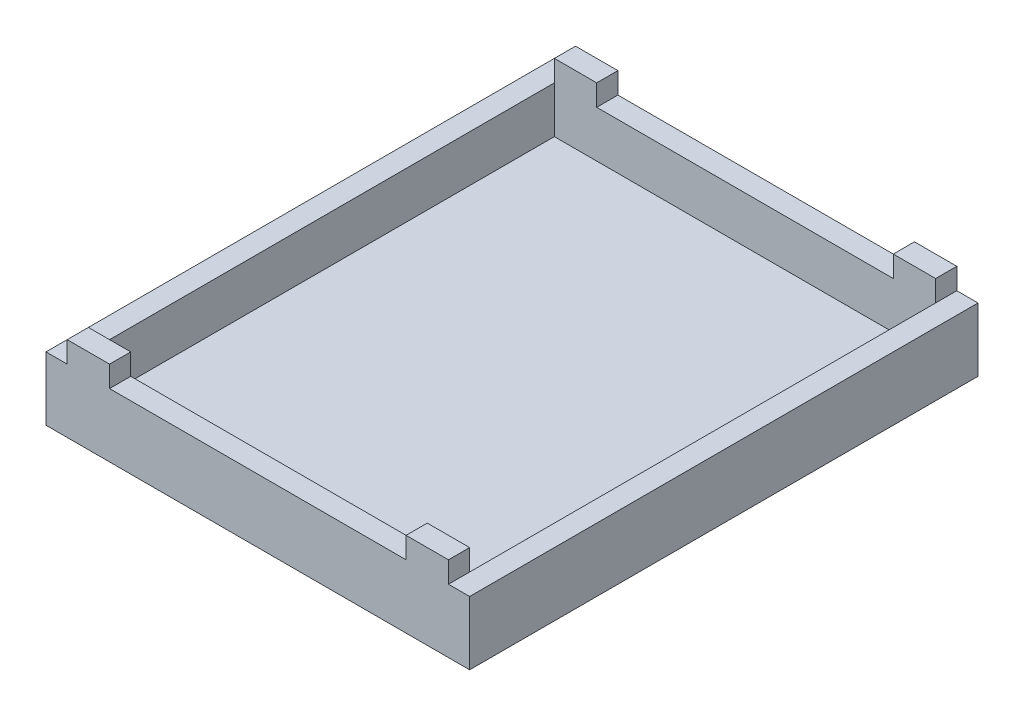
ISO-10303-21;
HEADER;
FILE_DESCRIPTION(('STEP AP214'),'2;1');
FILE_NAME('part.step','',(''),(''),'','','');
FILE_SCHEMA(('AUTOMOTIVE_DESIGN { 1 0 10303 214 1 1 1 1 }'));
ENDSEC;
DATA;
#1=APPLICATION_CONTEXT('core data for automotive mechanical design processes');
#2=APPLICATION_PROTOCOL_DEFINITION('international standard','automotive_design',2000,#1);
#3=PRODUCT_CONTEXT('',#1,'mechanical');
#4=PRODUCT('Part','Part','',(#3));
#5=PRODUCT_RELATED_PRODUCT_CATEGORY('part','',(#4));
#6=PRODUCT_DEFINITION_FORMATION('','',#4);
#7=PRODUCT_DEFINITION_CONTEXT('part definition',#1,'design');
#8=PRODUCT_DEFINITION('design','',#6,#7);
#9=PRODUCT_DEFINITION_SHAPE('','',#8);
#10=(LENGTH_UNIT() NAMED_UNIT(*) SI_UNIT(.MILLI.,.METRE.));
#11=(NAMED_UNIT(*) PLANE_ANGLE_UNIT() SI_UNIT($,.RADIAN.));
#12=(NAMED_UNIT(*) SI_UNIT($,.STERADIAN.) SOLID_ANGLE_UNIT());
#13=UNCERTAINTY_MEASURE_WITH_UNIT(LENGTH_MEASURE(1.E-05),#10,'distance_accuracy_value','');
#14=(GEOMETRIC_REPRESENTATION_CONTEXT(3) GLOBAL_UNCERTAINTY_ASSIGNED_CONTEXT((#13)) GLOBAL_UNIT_ASSIGNED_CONTEXT((#10,
#11,#12)) REPRESENTATION_CONTEXT('',''));
#15=CARTESIAN_POINT('',(0.,0.,0.));
#16=DIRECTION('',(0.,0.,1.));
#17=DIRECTION('',(1.,0.,0.));
#18=AXIS2_PLACEMENT_3D('',#15,#16,#17);
#19=CARTESIAN_POINT('',(0.,20.,0.));
#20=DIRECTION('',(0.,1.,0.));
#21=DIRECTION('',(0.,0.,1.));
#22=AXIS2_PLACEMENT_3D('',#19,#20,#21);
#23=PLANE('',#22);
#24=DIRECTION('',(0.,0.,1.));
#25=VECTOR('',#24,1.);
#26=CARTESIAN_POINT('',(-45.,20.,-60.));
#27=LINE('',#26,#25);
#28=CARTESIAN_POINT('',(-45.,20.,55.));
#29=VERTEX_POINT('',#28);
#30=CARTESIAN_POINT('',(-45.,20.,60.));
#31=VERTEX_POINT('',#30);
#32=EDGE_CURVE('E321',#29,#31,#27,.T.);
#33=ORIENTED_EDGE('',*,*,#32,.T.);
#34=DIRECTION('',(1.,0.,0.));
#35=VECTOR('',#34,1.);
#36=CARTESIAN_POINT('',(-50.,20.,60.));
#37=LINE('',#36,#35);
#38=CARTESIAN_POINT('',(-35.,20.,60.));
#39=VERTEX_POINT('',#38);
#40=EDGE_CURVE('E298',#31,#39,#37,.T.);
#41=ORIENTED_EDGE('',*,*,#40,.T.);
#42=DIRECTION('',(0.,0.,1.));
#43=VECTOR('',#42,1.);
#44=CARTESIAN_POINT('',(-35.,20.,-60.));
#45=LINE('',#44,#43);
#46=CARTESIAN_POINT('',(-35.,20.,55.));
#47=VERTEX_POINT('',#46);
#48=EDGE_CURVE('E320',#47,#39,#45,.T.);
#49=ORIENTED_EDGE('',*,*,#48,.F.);
#50=DIRECTION('',(1.,0.,0.));
#51=VECTOR('',#50,1.);
#52=CARTESIAN_POINT('',(-45.,20.,55.));
#53=LINE('',#52,#51);
#54=EDGE_CURVE('E252',#29,#47,#53,.T.);
#55=ORIENTED_EDGE('',*,*,#54,.F.);
#56=EDGE_LOOP('',(#33,#41,#49,#55));
#57=FACE_BOUND('',#56,.T.);
#58=ADVANCED_FACE('F41',(#57),#23,.T.);
#59=DIRECTION('',(0.,0.,1.));
#60=VECTOR('',#59,1.);
#61=CARTESIAN_POINT('',(45.,20.,-60.));
#62=LINE('',#61,#60);
#63=CARTESIAN_POINT('',(45.,20.,-60.));
#64=VERTEX_POINT('',#63);
#65=CARTESIAN_POINT('',(45.,20.,-55.));
#66=VERTEX_POINT('',#65);
#67=EDGE_CURVE('E432',#64,#66,#62,.T.);
#68=ORIENTED_EDGE('',*,*,#67,.F.);
#69=DIRECTION('',(-1.,0.,0.));
#70=VECTOR('',#69,1.);
#71=CARTESIAN_POINT('',(-50.,20.,-60.));
#72=LINE('',#71,#70);
#73=CARTESIAN_POINT('',(35.,20.,-60.));
#74=VERTEX_POINT('',#73);
#75=EDGE_CURVE('E293',#64,#74,#72,.T.);
#76=ORIENTED_EDGE('',*,*,#75,.T.);
#77=DIRECTION('',(0.,0.,1.));
#78=VECTOR('',#77,1.);
#79=CARTESIAN_POINT('',(35.,20.,-60.));
#80=LINE('',#79,#78);
#81=CARTESIAN_POINT('',(35.,20.,-55.));
#82=VERTEX_POINT('',#81);
#83=EDGE_CURVE('E349',#74,#82,#80,.T.);
#84=ORIENTED_EDGE('',*,*,#83,.T.);
#85=DIRECTION('',(-1.,0.,0.));
#86=VECTOR('',#85,1.);
#87=CARTESIAN_POINT('',(-45.,20.,-55.));
#88=LINE('',#87,#86);
#89=EDGE_CURVE('E265',#66,#82,#88,.T.);
#90=ORIENTED_EDGE('',*,*,#89,.F.);
#91=EDGE_LOOP('',(#68,#76,#84,#90));
#92=FACE_BOUND('',#91,.T.);
#93=ADVANCED_FACE('F483',(#92),#23,.T.);
#94=CARTESIAN_POINT('',(-45.,20.,-60.));
#95=VERTEX_POINT('',#94);
#96=CARTESIAN_POINT('',(-45.,20.,-55.));
#97=VERTEX_POINT('',#96);
#98=EDGE_CURVE('E365',#95,#97,#27,.T.);
#99=ORIENTED_EDGE('',*,*,#98,.T.);
#100=CARTESIAN_POINT('',(-35.,20.,-55.));
#101=VERTEX_POINT('',#100);
#102=EDGE_CURVE('E257',#101,#97,#88,.T.);
#103=ORIENTED_EDGE('',*,*,#102,.F.);
#104=CARTESIAN_POINT('',(-35.,20.,-60.));
#105=VERTEX_POINT('',#104);
#106=EDGE_CURVE('E345',#105,#101,#45,.T.);
#107=ORIENTED_EDGE('',*,*,#106,.F.);
#108=EDGE_CURVE('E289',#105,#95,#72,.T.);
#109=ORIENTED_EDGE('',*,*,#108,.T.);
#110=EDGE_LOOP('',(#99,#103,#107,#109));
#111=FACE_BOUND('',#110,.T.);
#112=ADVANCED_FACE('F470',(#111),#23,.T.);
#113=CARTESIAN_POINT('',(50.,20.,-60.));
#114=DIRECTION('',(-1.,0.,0.));
#115=DIRECTION('',(0.,0.,1.));
#116=AXIS2_PLACEMENT_3D('',#113,#114,#115);
#117=PLANE('',#116);
#118=DIRECTION('',(0.,-1.,0.));
#119=VECTOR('',#118,1.);
#120=CARTESIAN_POINT('',(50.,20.,-60.));
#121=LINE('',#120,#119);
#122=CARTESIAN_POINT('',(50.,15.,-60.));
#123=VERTEX_POINT('',#122);
#124=CARTESIAN_POINT('',(50.,0.,-60.));
#125=VERTEX_POINT('',#124);
#126=EDGE_CURVE('E221',#123,#125,#121,.T.);
#127=ORIENTED_EDGE('',*,*,#126,.F.);
#128=DIRECTION('',(0.,0.,1.));
#129=VECTOR('',#128,1.);
#130=CARTESIAN_POINT('',(50.,15.,-60.));
#131=LINE('',#130,#129);
#132=CARTESIAN_POINT('',(50.,15.,60.));
#133=VERTEX_POINT('',#132);
#134=EDGE_CURVE('E423',#123,#133,#131,.T.);
#135=ORIENTED_EDGE('',*,*,#134,.T.);
#136=DIRECTION('',(0.,-1.,0.));
#137=VECTOR('',#136,1.);
#138=CARTESIAN_POINT('',(50.,20.,60.));
#139=LINE('',#138,#137);
#140=CARTESIAN_POINT('',(50.,0.,60.));
#141=VERTEX_POINT('',#140);
#142=EDGE_CURVE('E227',#133,#141,#139,.T.);
#143=ORIENTED_EDGE('',*,*,#142,.T.);
#144=DIRECTION('',(0.,0.,-1.));
#145=VECTOR('',#144,1.);
#146=CARTESIAN_POINT('',(50.,0.,-60.));
#147=LINE('',#146,#145);
#148=EDGE_CURVE('E274',#141,#125,#147,.T.);
#149=ORIENTED_EDGE('',*,*,#148,.T.);
#150=EDGE_LOOP('',(#127,#135,#143,#149));
#151=FACE_BOUND('',#150,.T.);
#152=ADVANCED_FACE('F43',(#151),#117,.F.);
#153=CARTESIAN_POINT('',(-50.,20.,-60.));
#154=DIRECTION('',(0.,0.,1.));
#155=DIRECTION('',(1.,0.,0.));
#156=AXIS2_PLACEMENT_3D('',#153,#154,#155);
#157=PLANE('',#156);
#158=DIRECTION('',(1.,0.,0.));
#159=VECTOR('',#158,1.);
#160=CARTESIAN_POINT('',(-50.,15.,-60.));
#161=LINE('',#160,#159);
#162=CARTESIAN_POINT('',(-50.,15.,-60.));
#163=VERTEX_POINT('',#162);
#164=CARTESIAN_POINT('',(-45.,15.,-60.));
#165=VERTEX_POINT('',#164);
#166=EDGE_CURVE('E190',#163,#165,#161,.T.);
#167=ORIENTED_EDGE('',*,*,#166,.T.);
#168=DIRECTION('',(0.,1.,0.));
#169=VECTOR('',#168,1.);
#170=CARTESIAN_POINT('',(-45.,20.,-60.));
#171=LINE('',#170,#169);
#172=EDGE_CURVE('E203',#165,#95,#171,.T.);
#173=ORIENTED_EDGE('',*,*,#172,.T.);
#174=ORIENTED_EDGE('',*,*,#108,.F.);
#175=DIRECTION('',(0.,-1.,0.));
#176=VECTOR('',#175,1.);
#177=CARTESIAN_POINT('',(-35.,20.,-60.));
#178=LINE('',#177,#176);
#179=CARTESIAN_POINT('',(-35.,15.,-60.));
#180=VERTEX_POINT('',#179);
#181=EDGE_CURVE('E344',#105,#180,#178,.T.);
#182=ORIENTED_EDGE('',*,*,#181,.T.);
#183=DIRECTION('',(1.,0.,0.));
#184=VECTOR('',#183,1.);
#185=CARTESIAN_POINT('',(-35.,15.,-60.));
#186=LINE('',#185,#184);
#187=CARTESIAN_POINT('',(35.,15.,-60.));
#188=VERTEX_POINT('',#187);
#189=EDGE_CURVE('E437',#180,#188,#186,.T.);
#190=ORIENTED_EDGE('',*,*,#189,.T.);
#191=DIRECTION('',(0.,1.,0.));
#192=VECTOR('',#191,1.);
#193=CARTESIAN_POINT('',(35.,20.,-60.));
#194=LINE('',#193,#192);
#195=EDGE_CURVE('E339',#188,#74,#194,.T.);
#196=ORIENTED_EDGE('',*,*,#195,.T.);
#197=ORIENTED_EDGE('',*,*,#75,.F.);
#198=DIRECTION('',(0.,-1.,0.));
#199=VECTOR('',#198,1.);
#200=CARTESIAN_POINT('',(45.,20.,-60.));
#201=LINE('',#200,#199);
#202=CARTESIAN_POINT('',(45.,15.,-60.));
#203=VERTEX_POINT('',#202);
#204=EDGE_CURVE('E409',#64,#203,#201,.T.);
#205=ORIENTED_EDGE('',*,*,#204,.T.);
#206=DIRECTION('',(1.,0.,0.));
#207=VECTOR('',#206,1.);
#208=CARTESIAN_POINT('',(50.,15.,-60.));
#209=LINE('',#208,#207);
#210=EDGE_CURVE('E413',#203,#123,#209,.T.);
#211=ORIENTED_EDGE('',*,*,#210,.T.);
#212=ORIENTED_EDGE('',*,*,#126,.T.);
#213=DIRECTION('',(-1.,0.,0.));
#214=VECTOR('',#213,1.);
#215=CARTESIAN_POINT('',(-50.,0.,-60.));
#216=LINE('',#215,#214);
#217=CARTESIAN_POINT('',(-50.,0.,-60.));
#218=VERTEX_POINT('',#217);
#219=EDGE_CURVE('E218',#125,#218,#216,.T.);
#220=ORIENTED_EDGE('',*,*,#219,.T.);
#221=DIRECTION('',(0.,-1.,0.));
#222=VECTOR('',#221,1.);
#223=CARTESIAN_POINT('',(-50.,20.,-60.));
#224=LINE('',#223,#222);
#225=EDGE_CURVE('E210',#163,#218,#224,.T.);
#226=ORIENTED_EDGE('',*,*,#225,.F.);
#227=EDGE_LOOP('',(#167,#173,#174,#182,#190,#196,#197,#205,#211,#212,#220,#226));
#228=FACE_BOUND('',#227,.T.);
#229=ADVANCED_FACE('F216',(#228),#157,.F.);
#230=CARTESIAN_POINT('',(-50.,20.,-60.));
#231=DIRECTION('',(1.,0.,0.));
#232=DIRECTION('',(0.,0.,-1.));
#233=AXIS2_PLACEMENT_3D('',#230,#231,#232);
#234=PLANE('',#233);
#235=DIRECTION('',(0.,-1.,0.));
#236=VECTOR('',#235,1.);
#237=CARTESIAN_POINT('',(-50.,20.,60.));
#238=LINE('',#237,#236);
#239=CARTESIAN_POINT('',(-50.,15.,60.));
#240=VERTEX_POINT('',#239);
#241=CARTESIAN_POINT('',(-50.,0.,60.));
#242=VERTEX_POINT('',#241);
#243=EDGE_CURVE('E212',#240,#242,#238,.T.);
#244=ORIENTED_EDGE('',*,*,#243,.F.);
#245=DIRECTION('',(0.,0.,1.));
#246=VECTOR('',#245,1.);
#247=CARTESIAN_POINT('',(-50.,15.,-60.));
#248=LINE('',#247,#246);
#249=EDGE_CURVE('E194',#163,#240,#248,.T.);
#250=ORIENTED_EDGE('',*,*,#249,.F.);
#251=ORIENTED_EDGE('',*,*,#225,.T.);
#252=DIRECTION('',(0.,0.,1.));
#253=VECTOR('',#252,1.);
#254=CARTESIAN_POINT('',(-50.,0.,-60.));
#255=LINE('',#254,#253);
#256=EDGE_CURVE('E304',#218,#242,#255,.T.);
#257=ORIENTED_EDGE('',*,*,#256,.T.);
#258=EDGE_LOOP('',(#244,#250,#251,#257));
#259=FACE_BOUND('',#258,.T.);
#260=ADVANCED_FACE('F208',(#259),#234,.F.);
#261=CARTESIAN_POINT('',(-50.,20.,60.));
#262=DIRECTION('',(0.,0.,-1.));
#263=DIRECTION('',(-1.,0.,0.));
#264=AXIS2_PLACEMENT_3D('',#261,#262,#263);
#265=PLANE('',#264);
#266=ORIENTED_EDGE('',*,*,#40,.F.);
#267=DIRECTION('',(0.,1.,0.));
#268=VECTOR('',#267,1.);
#269=CARTESIAN_POINT('',(-45.,20.,60.));
#270=LINE('',#269,#268);
#271=CARTESIAN_POINT('',(-45.,15.,60.));
#272=VERTEX_POINT('',#271);
#273=EDGE_CURVE('E204',#272,#31,#270,.T.);
#274=ORIENTED_EDGE('',*,*,#273,.F.);
#275=DIRECTION('',(1.,0.,0.));
#276=VECTOR('',#275,1.);
#277=CARTESIAN_POINT('',(-50.,15.,60.));
#278=LINE('',#277,#276);
#279=EDGE_CURVE('E398',#240,#272,#278,.T.);
#280=ORIENTED_EDGE('',*,*,#279,.F.);
#281=ORIENTED_EDGE('',*,*,#243,.T.);
#282=DIRECTION('',(1.,0.,0.));
#283=VECTOR('',#282,1.);
#284=CARTESIAN_POINT('',(-50.,0.,60.));
#285=LINE('',#284,#283);
#286=EDGE_CURVE('E294',#242,#141,#285,.T.);
#287=ORIENTED_EDGE('',*,*,#286,.T.);
#288=ORIENTED_EDGE('',*,*,#142,.F.);
#289=DIRECTION('',(1.,0.,0.));
#290=VECTOR('',#289,1.);
#291=CARTESIAN_POINT('',(50.,15.,60.));
#292=LINE('',#291,#290);
#293=CARTESIAN_POINT('',(45.,15.,60.));
#294=VERTEX_POINT('',#293);
#295=EDGE_CURVE('E414',#294,#133,#292,.T.);
#296=ORIENTED_EDGE('',*,*,#295,.F.);
#297=DIRECTION('',(0.,-1.,0.));
#298=VECTOR('',#297,1.);
#299=CARTESIAN_POINT('',(45.,20.,60.));
#300=LINE('',#299,#298);
#301=CARTESIAN_POINT('',(45.,20.,60.));
#302=VERTEX_POINT('',#301);
#303=EDGE_CURVE('E348',#302,#294,#300,.T.);
#304=ORIENTED_EDGE('',*,*,#303,.F.);
#305=CARTESIAN_POINT('',(35.,20.,60.));
#306=VERTEX_POINT('',#305);
#307=EDGE_CURVE('E295',#306,#302,#37,.T.);
#308=ORIENTED_EDGE('',*,*,#307,.F.);
#309=DIRECTION('',(0.,1.,0.));
#310=VECTOR('',#309,1.);
#311=CARTESIAN_POINT('',(35.,20.,60.));
#312=LINE('',#311,#310);
#313=CARTESIAN_POINT('',(35.,15.,60.));
#314=VERTEX_POINT('',#313);
#315=EDGE_CURVE('E336',#314,#306,#312,.T.);
#316=ORIENTED_EDGE('',*,*,#315,.F.);
#317=DIRECTION('',(1.,0.,0.));
#318=VECTOR('',#317,1.);
#319=CARTESIAN_POINT('',(-35.,15.,60.));
#320=LINE('',#319,#318);
#321=CARTESIAN_POINT('',(-35.,15.,60.));
#322=VERTEX_POINT('',#321);
#323=EDGE_CURVE('E330',#322,#314,#320,.T.);
#324=ORIENTED_EDGE('',*,*,#323,.F.);
#325=DIRECTION('',(0.,-1.,0.));
#326=VECTOR('',#325,1.);
#327=CARTESIAN_POINT('',(-35.,20.,60.));
#328=LINE('',#327,#326);
#329=EDGE_CURVE('E328',#39,#322,#328,.T.);
#330=ORIENTED_EDGE('',*,*,#329,.F.);
#331=EDGE_LOOP('',(#266,#274,#280,#281,#287,#288,#296,#304,#308,#316,#324,#330));
#332=FACE_BOUND('',#331,.T.);
#333=ADVANCED_FACE('F325',(#332),#265,.F.);
#334=CARTESIAN_POINT('',(45.,20.,55.));
#335=VERTEX_POINT('',#334);
#336=EDGE_CURVE('E250',#335,#302,#62,.T.);
#337=ORIENTED_EDGE('',*,*,#336,.F.);
#338=CARTESIAN_POINT('',(35.,20.,55.));
#339=VERTEX_POINT('',#338);
#340=EDGE_CURVE('E241',#339,#335,#53,.T.);
#341=ORIENTED_EDGE('',*,*,#340,.F.);
#342=EDGE_CURVE('E248',#339,#306,#80,.T.);
#343=ORIENTED_EDGE('',*,*,#342,.T.);
#344=ORIENTED_EDGE('',*,*,#307,.T.);
#345=EDGE_LOOP('',(#337,#341,#343,#344));
#346=FACE_BOUND('',#345,.T.);
#347=ADVANCED_FACE('F246',(#346),#23,.T.);
#348=CARTESIAN_POINT('',(0.,0.,0.));
#349=DIRECTION('',(0.,1.,0.));
#350=DIRECTION('',(0.,0.,1.));
#351=AXIS2_PLACEMENT_3D('',#348,#349,#350);
#352=PLANE('',#351);
#353=ORIENTED_EDGE('',*,*,#148,.F.);
#354=ORIENTED_EDGE('',*,*,#286,.F.);
#355=ORIENTED_EDGE('',*,*,#256,.F.);
#356=ORIENTED_EDGE('',*,*,#219,.F.);
#357=EDGE_LOOP('',(#353,#354,#355,#356));
#358=FACE_BOUND('',#357,.T.);
#359=ADVANCED_FACE('F513',(#358),#352,.F.);
#360=CARTESIAN_POINT('',(-45.,4.,-55.));
#361=DIRECTION('',(-1.,0.,0.));
#362=DIRECTION('',(0.,0.,1.));
#363=AXIS2_PLACEMENT_3D('',#360,#361,#362);
#364=PLANE('',#363);
#365=DIRECTION('',(0.,1.,0.));
#366=VECTOR('',#365,1.);
#367=CARTESIAN_POINT('',(-45.,4.,-55.));
#368=LINE('',#367,#366);
#369=CARTESIAN_POINT('',(-45.,4.,-55.));
#370=VERTEX_POINT('',#369);
#371=CARTESIAN_POINT('',(-45.,15.,-55.));
#372=VERTEX_POINT('',#371);
#373=EDGE_CURVE('E270',#370,#372,#368,.T.);
#374=ORIENTED_EDGE('',*,*,#373,.T.);
#375=DIRECTION('',(0.,0.,1.));
#376=VECTOR('',#375,1.);
#377=CARTESIAN_POINT('',(-45.,15.,-60.));
#378=LINE('',#377,#376);
#379=CARTESIAN_POINT('',(-45.,15.,55.));
#380=VERTEX_POINT('',#379);
#381=EDGE_CURVE('E397',#372,#380,#378,.T.);
#382=ORIENTED_EDGE('',*,*,#381,.T.);
#383=DIRECTION('',(0.,1.,0.));
#384=VECTOR('',#383,1.);
#385=CARTESIAN_POINT('',(-45.,4.,55.));
#386=LINE('',#385,#384);
#387=CARTESIAN_POINT('',(-45.,4.,55.));
#388=VERTEX_POINT('',#387);
#389=EDGE_CURVE('E284',#388,#380,#386,.T.);
#390=ORIENTED_EDGE('',*,*,#389,.F.);
#391=DIRECTION('',(0.,0.,1.));
#392=VECTOR('',#391,1.);
#393=CARTESIAN_POINT('',(-45.,4.,-55.));
#394=LINE('',#393,#392);
#395=EDGE_CURVE('E269',#370,#388,#394,.T.);
#396=ORIENTED_EDGE('',*,*,#395,.F.);
#397=EDGE_LOOP('',(#374,#382,#390,#396));
#398=FACE_BOUND('',#397,.T.);
#399=ADVANCED_FACE('F402',(#398),#364,.F.);
#400=CARTESIAN_POINT('',(-45.,4.,-55.));
#401=DIRECTION('',(0.,0.,-1.));
#402=DIRECTION('',(-1.,0.,0.));
#403=AXIS2_PLACEMENT_3D('',#400,#401,#402);
#404=PLANE('',#403);
#405=DIRECTION('',(-1.,0.,0.));
#406=VECTOR('',#405,1.);
#407=CARTESIAN_POINT('',(-45.,15.,-55.));
#408=LINE('',#407,#406);
#409=CARTESIAN_POINT('',(35.,15.,-55.));
#410=VERTEX_POINT('',#409);
#411=CARTESIAN_POINT('',(-35.,15.,-55.));
#412=VERTEX_POINT('',#411);
#413=EDGE_CURVE('E360',#410,#412,#408,.T.);
#414=ORIENTED_EDGE('',*,*,#413,.T.);
#415=DIRECTION('',(0.,1.,0.));
#416=VECTOR('',#415,1.);
#417=CARTESIAN_POINT('',(-35.,4.,-55.));
#418=LINE('',#417,#416);
#419=EDGE_CURVE('E369',#412,#101,#418,.T.);
#420=ORIENTED_EDGE('',*,*,#419,.T.);
#421=ORIENTED_EDGE('',*,*,#102,.T.);
#422=DIRECTION('',(0.,-1.,0.));
#423=VECTOR('',#422,1.);
#424=CARTESIAN_POINT('',(-45.,4.,-55.));
#425=LINE('',#424,#423);
#426=EDGE_CURVE('E253',#97,#372,#425,.T.);
#427=ORIENTED_EDGE('',*,*,#426,.T.);
#428=ORIENTED_EDGE('',*,*,#373,.F.);
#429=DIRECTION('',(-1.,0.,0.));
#430=VECTOR('',#429,1.);
#431=CARTESIAN_POINT('',(-45.,4.,-55.));
#432=LINE('',#431,#430);
#433=CARTESIAN_POINT('',(45.,4.,-55.));
#434=VERTEX_POINT('',#433);
#435=EDGE_CURVE('E263',#434,#370,#432,.T.);
#436=ORIENTED_EDGE('',*,*,#435,.F.);
#437=DIRECTION('',(0.,1.,0.));
#438=VECTOR('',#437,1.);
#439=CARTESIAN_POINT('',(45.,4.,-55.));
#440=LINE('',#439,#438);
#441=CARTESIAN_POINT('',(45.,15.,-55.));
#442=VERTEX_POINT('',#441);
#443=EDGE_CURVE('E275',#434,#442,#440,.T.);
#444=ORIENTED_EDGE('',*,*,#443,.T.);
#445=DIRECTION('',(0.,1.,0.));
#446=VECTOR('',#445,1.);
#447=CARTESIAN_POINT('',(45.,4.,-55.));
#448=LINE('',#447,#446);
#449=EDGE_CURVE('E259',#442,#66,#448,.T.);
#450=ORIENTED_EDGE('',*,*,#449,.T.);
#451=ORIENTED_EDGE('',*,*,#89,.T.);
#452=DIRECTION('',(0.,-1.,0.));
#453=VECTOR('',#452,1.);
#454=CARTESIAN_POINT('',(35.,4.,-55.));
#455=LINE('',#454,#453);
#456=EDGE_CURVE('E364',#82,#410,#455,.T.);
#457=ORIENTED_EDGE('',*,*,#456,.T.);
#458=EDGE_LOOP('',(#414,#420,#421,#427,#428,#436,#444,#450,#451,#457));
#459=FACE_BOUND('',#458,.T.);
#460=ADVANCED_FACE('F476',(#459),#404,.F.);
#461=CARTESIAN_POINT('',(45.,4.,-55.));
#462=DIRECTION('',(1.,0.,0.));
#463=DIRECTION('',(0.,0.,-1.));
#464=AXIS2_PLACEMENT_3D('',#461,#462,#463);
#465=PLANE('',#464);
#466=DIRECTION('',(0.,1.,0.));
#467=VECTOR('',#466,1.);
#468=CARTESIAN_POINT('',(45.,4.,55.));
#469=LINE('',#468,#467);
#470=CARTESIAN_POINT('',(45.,4.,55.));
#471=VERTEX_POINT('',#470);
#472=CARTESIAN_POINT('',(45.,15.,55.));
#473=VERTEX_POINT('',#472);
#474=EDGE_CURVE('E279',#471,#473,#469,.T.);
#475=ORIENTED_EDGE('',*,*,#474,.T.);
#476=DIRECTION('',(0.,0.,1.));
#477=VECTOR('',#476,1.);
#478=CARTESIAN_POINT('',(45.,15.,-60.));
#479=LINE('',#478,#477);
#480=EDGE_CURVE('E430',#442,#473,#479,.T.);
#481=ORIENTED_EDGE('',*,*,#480,.F.);
#482=ORIENTED_EDGE('',*,*,#443,.F.);
#483=DIRECTION('',(0.,0.,-1.));
#484=VECTOR('',#483,1.);
#485=CARTESIAN_POINT('',(45.,4.,-55.));
#486=LINE('',#485,#484);
#487=EDGE_CURVE('E382',#471,#434,#486,.T.);
#488=ORIENTED_EDGE('',*,*,#487,.F.);
#489=EDGE_LOOP('',(#475,#481,#482,#488));
#490=FACE_BOUND('',#489,.T.);
#491=ADVANCED_FACE('F491',(#490),#465,.F.);
#492=CARTESIAN_POINT('',(-45.,4.,55.));
#493=DIRECTION('',(0.,0.,1.));
#494=DIRECTION('',(1.,0.,0.));
#495=AXIS2_PLACEMENT_3D('',#492,#493,#494);
#496=PLANE('',#495);
#497=ORIENTED_EDGE('',*,*,#54,.T.);
#498=DIRECTION('',(0.,-1.,0.));
#499=VECTOR('',#498,1.);
#500=CARTESIAN_POINT('',(-35.,4.,55.));
#501=LINE('',#500,#499);
#502=CARTESIAN_POINT('',(-35.,15.,55.));
#503=VERTEX_POINT('',#502);
#504=EDGE_CURVE('E11',#47,#503,#501,.T.);
#505=ORIENTED_EDGE('',*,*,#504,.T.);
#506=DIRECTION('',(1.,0.,0.));
#507=VECTOR('',#506,1.);
#508=CARTESIAN_POINT('',(-45.,15.,55.));
#509=LINE('',#508,#507);
#510=CARTESIAN_POINT('',(35.,15.,55.));
#511=VERTEX_POINT('',#510);
#512=EDGE_CURVE('E225',#503,#511,#509,.T.);
#513=ORIENTED_EDGE('',*,*,#512,.T.);
#514=DIRECTION('',(0.,1.,0.));
#515=VECTOR('',#514,1.);
#516=CARTESIAN_POINT('',(35.,4.,55.));
#517=LINE('',#516,#515);
#518=EDGE_CURVE('E50',#511,#339,#517,.T.);
#519=ORIENTED_EDGE('',*,*,#518,.T.);
#520=ORIENTED_EDGE('',*,*,#340,.T.);
#521=EDGE_CURVE('E283',#473,#335,#469,.T.);
#522=ORIENTED_EDGE('',*,*,#521,.F.);
#523=ORIENTED_EDGE('',*,*,#474,.F.);
#524=DIRECTION('',(1.,0.,0.));
#525=VECTOR('',#524,1.);
#526=CARTESIAN_POINT('',(-45.,4.,55.));
#527=LINE('',#526,#525);
#528=EDGE_CURVE('E379',#388,#471,#527,.T.);
#529=ORIENTED_EDGE('',*,*,#528,.F.);
#530=ORIENTED_EDGE('',*,*,#389,.T.);
#531=EDGE_CURVE('E288',#380,#29,#386,.T.);
#532=ORIENTED_EDGE('',*,*,#531,.T.);
#533=EDGE_LOOP('',(#497,#505,#513,#519,#520,#522,#523,#529,#530,#532));
#534=FACE_BOUND('',#533,.T.);
#535=ADVANCED_FACE('F239',(#534),#496,.F.);
#536=CARTESIAN_POINT('',(0.,4.,0.));
#537=DIRECTION('',(0.,1.,0.));
#538=DIRECTION('',(0.,0.,1.));
#539=AXIS2_PLACEMENT_3D('',#536,#537,#538);
#540=PLANE('',#539);
#541=ORIENTED_EDGE('',*,*,#395,.T.);
#542=ORIENTED_EDGE('',*,*,#528,.T.);
#543=ORIENTED_EDGE('',*,*,#487,.T.);
#544=ORIENTED_EDGE('',*,*,#435,.T.);
#545=EDGE_LOOP('',(#541,#542,#543,#544));
#546=FACE_BOUND('',#545,.T.);
#547=ADVANCED_FACE('F494',(#546),#540,.T.);
#548=CARTESIAN_POINT('',(-35.,15.,-60.));
#549=DIRECTION('',(0.,-1.,0.));
#550=DIRECTION('',(0.,0.,-1.));
#551=AXIS2_PLACEMENT_3D('',#548,#549,#550);
#552=PLANE('',#551);
#553=DIRECTION('',(0.,0.,1.));
#554=VECTOR('',#553,1.);
#555=CARTESIAN_POINT('',(-35.,15.,-60.));
#556=LINE('',#555,#554);
#557=EDGE_CURVE('E359',#503,#322,#556,.T.);
#558=ORIENTED_EDGE('',*,*,#557,.T.);
#559=ORIENTED_EDGE('',*,*,#323,.T.);
#560=DIRECTION('',(0.,0.,1.));
#561=VECTOR('',#560,1.);
#562=CARTESIAN_POINT('',(35.,15.,-60.));
#563=LINE('',#562,#561);
#564=EDGE_CURVE('E65',#511,#314,#563,.T.);
#565=ORIENTED_EDGE('',*,*,#564,.F.);
#566=ORIENTED_EDGE('',*,*,#512,.F.);
#567=EDGE_LOOP('',(#558,#559,#565,#566));
#568=FACE_BOUND('',#567,.T.);
#569=ADVANCED_FACE('F446',(#568),#552,.F.);
#570=CARTESIAN_POINT('',(35.,20.,-60.));
#571=DIRECTION('',(1.,0.,0.));
#572=DIRECTION('',(0.,0.,-1.));
#573=AXIS2_PLACEMENT_3D('',#570,#571,#572);
#574=PLANE('',#573);
#575=ORIENTED_EDGE('',*,*,#564,.T.);
#576=ORIENTED_EDGE('',*,*,#315,.T.);
#577=ORIENTED_EDGE('',*,*,#342,.F.);
#578=ORIENTED_EDGE('',*,*,#518,.F.);
#579=EDGE_LOOP('',(#575,#576,#577,#578));
#580=FACE_BOUND('',#579,.T.);
#581=ADVANCED_FACE('F451',(#580),#574,.F.);
#582=CARTESIAN_POINT('',(-35.,20.,-60.));
#583=DIRECTION('',(-1.,0.,0.));
#584=DIRECTION('',(0.,0.,1.));
#585=AXIS2_PLACEMENT_3D('',#582,#583,#584);
#586=PLANE('',#585);
#587=ORIENTED_EDGE('',*,*,#48,.T.);
#588=ORIENTED_EDGE('',*,*,#329,.T.);
#589=ORIENTED_EDGE('',*,*,#557,.F.);
#590=ORIENTED_EDGE('',*,*,#504,.F.);
#591=EDGE_LOOP('',(#587,#588,#589,#590));
#592=FACE_BOUND('',#591,.T.);
#593=ADVANCED_FACE('F447',(#592),#586,.F.);
#594=CARTESIAN_POINT('',(45.,20.,-60.));
#595=DIRECTION('',(-1.,0.,0.));
#596=DIRECTION('',(0.,0.,1.));
#597=AXIS2_PLACEMENT_3D('',#594,#595,#596);
#598=PLANE('',#597);
#599=EDGE_CURVE('E426',#203,#442,#479,.T.);
#600=ORIENTED_EDGE('',*,*,#599,.F.);
#601=ORIENTED_EDGE('',*,*,#204,.F.);
#602=ORIENTED_EDGE('',*,*,#67,.T.);
#603=ORIENTED_EDGE('',*,*,#449,.F.);
#604=EDGE_LOOP('',(#600,#601,#602,#603));
#605=FACE_BOUND('',#604,.T.);
#606=ADVANCED_FACE('F485',(#605),#598,.F.);
#607=ORIENTED_EDGE('',*,*,#336,.T.);
#608=ORIENTED_EDGE('',*,*,#303,.T.);
#609=EDGE_CURVE('E431',#473,#294,#479,.T.);
#610=ORIENTED_EDGE('',*,*,#609,.F.);
#611=ORIENTED_EDGE('',*,*,#521,.T.);
#612=EDGE_LOOP('',(#607,#608,#610,#611));
#613=FACE_BOUND('',#612,.T.);
#614=ADVANCED_FACE('F456',(#613),#598,.F.);
#615=CARTESIAN_POINT('',(50.,15.,-60.));
#616=DIRECTION('',(0.,-1.,0.));
#617=DIRECTION('',(0.,0.,-1.));
#618=AXIS2_PLACEMENT_3D('',#615,#616,#617);
#619=PLANE('',#618);
#620=ORIENTED_EDGE('',*,*,#295,.T.);
#621=ORIENTED_EDGE('',*,*,#134,.F.);
#622=ORIENTED_EDGE('',*,*,#210,.F.);
#623=ORIENTED_EDGE('',*,*,#599,.T.);
#624=ORIENTED_EDGE('',*,*,#480,.T.);
#625=ORIENTED_EDGE('',*,*,#609,.T.);
#626=EDGE_LOOP('',(#620,#621,#622,#623,#624,#625));
#627=FACE_BOUND('',#626,.T.);
#628=ADVANCED_FACE('F489',(#627),#619,.F.);
#629=CARTESIAN_POINT('',(-45.,20.,-60.));
#630=DIRECTION('',(1.,0.,0.));
#631=DIRECTION('',(0.,0.,-1.));
#632=AXIS2_PLACEMENT_3D('',#629,#630,#631);
#633=PLANE('',#632);
#634=ORIENTED_EDGE('',*,*,#98,.F.);
#635=ORIENTED_EDGE('',*,*,#172,.F.);
#636=EDGE_CURVE('E197',#165,#372,#378,.T.);
#637=ORIENTED_EDGE('',*,*,#636,.T.);
#638=ORIENTED_EDGE('',*,*,#426,.F.);
#639=EDGE_LOOP('',(#634,#635,#637,#638));
#640=FACE_BOUND('',#639,.T.);
#641=ADVANCED_FACE('F620',(#640),#633,.F.);
#642=EDGE_CURVE('E214',#380,#272,#378,.T.);
#643=ORIENTED_EDGE('',*,*,#642,.T.);
#644=ORIENTED_EDGE('',*,*,#273,.T.);
#645=ORIENTED_EDGE('',*,*,#32,.F.);
#646=ORIENTED_EDGE('',*,*,#531,.F.);
#647=EDGE_LOOP('',(#643,#644,#645,#646));
#648=FACE_BOUND('',#647,.T.);
#649=ADVANCED_FACE('F395',(#648),#633,.F.);
#650=CARTESIAN_POINT('',(-50.,15.,-60.));
#651=DIRECTION('',(0.,-1.,0.));
#652=DIRECTION('',(0.,0.,-1.));
#653=AXIS2_PLACEMENT_3D('',#650,#651,#652);
#654=PLANE('',#653);
#655=ORIENTED_EDGE('',*,*,#279,.T.);
#656=ORIENTED_EDGE('',*,*,#642,.F.);
#657=ORIENTED_EDGE('',*,*,#381,.F.);
#658=ORIENTED_EDGE('',*,*,#636,.F.);
#659=ORIENTED_EDGE('',*,*,#166,.F.);
#660=ORIENTED_EDGE('',*,*,#249,.T.);
#661=EDGE_LOOP('',(#655,#656,#657,#658,#659,#660));
#662=FACE_BOUND('',#661,.T.);
#663=ADVANCED_FACE('F193',(#662),#654,.F.);
#664=EDGE_CURVE('E57',#180,#412,#556,.T.);
#665=ORIENTED_EDGE('',*,*,#664,.F.);
#666=ORIENTED_EDGE('',*,*,#181,.F.);
#667=ORIENTED_EDGE('',*,*,#106,.T.);
#668=ORIENTED_EDGE('',*,*,#419,.F.);
#669=EDGE_LOOP('',(#665,#666,#667,#668));
#670=FACE_BOUND('',#669,.T.);
#671=ADVANCED_FACE('F474',(#670),#586,.F.);
#672=ORIENTED_EDGE('',*,*,#83,.F.);
#673=ORIENTED_EDGE('',*,*,#195,.F.);
#674=EDGE_CURVE('E353',#188,#410,#563,.T.);
#675=ORIENTED_EDGE('',*,*,#674,.T.);
#676=ORIENTED_EDGE('',*,*,#456,.F.);
#677=EDGE_LOOP('',(#672,#673,#675,#676));
#678=FACE_BOUND('',#677,.T.);
#679=ADVANCED_FACE('F479',(#678),#574,.F.);
#680=ORIENTED_EDGE('',*,*,#674,.F.);
#681=ORIENTED_EDGE('',*,*,#189,.F.);
#682=ORIENTED_EDGE('',*,*,#664,.T.);
#683=ORIENTED_EDGE('',*,*,#413,.F.);
#684=EDGE_LOOP('',(#680,#681,#682,#683));
#685=FACE_BOUND('',#684,.T.);
#686=ADVANCED_FACE('F477',(#685),#552,.F.);
#687=CLOSED_SHELL('',(#58,#93,#112,#152,#229,#260,#333,#347,#359,#399,#460,#491,#535,#547,#569,
#581,#593,#606,#614,#628,#641,#649,#663,#671,#679,#686));
#688=MANIFOLD_SOLID_BREP('B2',#687);
#689=ADVANCED_BREP_SHAPE_REPRESENTATION('',(#18,#688),#14);
#690=SHAPE_DEFINITION_REPRESENTATION(#9,#689);
ENDSEC;
END-ISO-10303-21;
